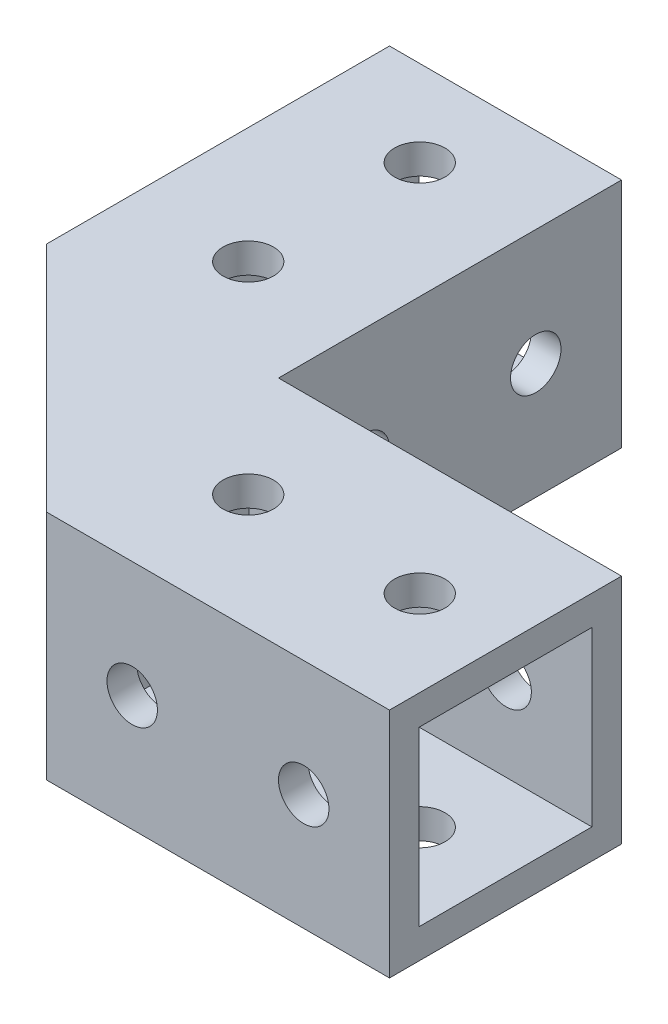
ISO-10303-21;
HEADER;
FILE_DESCRIPTION(('STEP AP214'),'2;1');
FILE_NAME('part.step','',(''),(''),'','','');
FILE_SCHEMA(('AUTOMOTIVE_DESIGN { 1 0 10303 214 1 1 1 1 }'));
ENDSEC;
DATA;
#1=APPLICATION_CONTEXT('core data for automotive mechanical design processes');
#2=APPLICATION_PROTOCOL_DEFINITION('international standard','automotive_design',2000,#1);
#3=PRODUCT_CONTEXT('',#1,'mechanical');
#4=PRODUCT('Part','Part','',(#3));
#5=PRODUCT_RELATED_PRODUCT_CATEGORY('part','',(#4));
#6=PRODUCT_DEFINITION_FORMATION('','',#4);
#7=PRODUCT_DEFINITION_CONTEXT('part definition',#1,'design');
#8=PRODUCT_DEFINITION('design','',#6,#7);
#9=PRODUCT_DEFINITION_SHAPE('','',#8);
#10=(LENGTH_UNIT() NAMED_UNIT(*) SI_UNIT(.MILLI.,.METRE.));
#11=(NAMED_UNIT(*) PLANE_ANGLE_UNIT() SI_UNIT($,.RADIAN.));
#12=(NAMED_UNIT(*) SI_UNIT($,.STERADIAN.) SOLID_ANGLE_UNIT());
#13=UNCERTAINTY_MEASURE_WITH_UNIT(LENGTH_MEASURE(1.E-05),#10,'distance_accuracy_value','');
#14=(GEOMETRIC_REPRESENTATION_CONTEXT(3) GLOBAL_UNCERTAINTY_ASSIGNED_CONTEXT((#13)) GLOBAL_UNIT_ASSIGNED_CONTEXT((#10,
#11,#12)) REPRESENTATION_CONTEXT('',''));
#15=CARTESIAN_POINT('',(0.,0.,0.));
#16=DIRECTION('',(0.,0.,1.));
#17=DIRECTION('',(1.,0.,0.));
#18=AXIS2_PLACEMENT_3D('',#15,#16,#17);
#19=CARTESIAN_POINT('',(0.,23.,0.));
#20=DIRECTION('',(0.,0.,1.));
#21=DIRECTION('',(1.,0.,0.));
#22=AXIS2_PLACEMENT_3D('',#19,#20,#21);
#23=PLANE('',#22);
#24=CARTESIAN_POINT('',(8.49999999999997,11.5,0.));
#25=DIRECTION('',(0.,0.,-1.));
#26=DIRECTION('',(-1.,0.,0.));
#27=AXIS2_PLACEMENT_3D('',#24,#25,#26);
#28=CIRCLE('',#27,2.5);
#29=CARTESIAN_POINT('',(5.99999999999997,11.5,0.));
#30=VERTEX_POINT('',#29);
#31=EDGE_CURVE('E438',#30,#30,#28,.T.);
#32=ORIENTED_EDGE('',*,*,#31,.F.);
#33=EDGE_LOOP('',(#32));
#34=FACE_BOUND('',#33,.T.);
#35=CARTESIAN_POINT('',(25.5,11.5,0.));
#36=DIRECTION('',(0.,0.,-1.));
#37=DIRECTION('',(-1.,0.,0.));
#38=AXIS2_PLACEMENT_3D('',#35,#36,#37);
#39=CIRCLE('',#38,2.5);
#40=CARTESIAN_POINT('',(23.,11.5,0.));
#41=VERTEX_POINT('',#40);
#42=EDGE_CURVE('E442',#41,#41,#39,.T.);
#43=ORIENTED_EDGE('',*,*,#42,.F.);
#44=EDGE_LOOP('',(#43));
#45=FACE_BOUND('',#44,.T.);
#46=DIRECTION('',(1.,0.,0.));
#47=VECTOR('',#46,1.);
#48=CARTESIAN_POINT('',(0.,4.,0.));
#49=LINE('',#48,#47);
#50=CARTESIAN_POINT('',(0.,4.,0.));
#51=VERTEX_POINT('',#50);
#52=CARTESIAN_POINT('',(17.,4.,0.));
#53=VERTEX_POINT('',#52);
#54=EDGE_CURVE('E185',#51,#53,#49,.T.);
#55=ORIENTED_EDGE('',*,*,#54,.F.);
#56=DIRECTION('',(0.,-1.,0.));
#57=VECTOR('',#56,1.);
#58=CARTESIAN_POINT('',(0.,23.,0.));
#59=LINE('',#58,#57);
#60=CARTESIAN_POINT('',(0.,23.,0.));
#61=VERTEX_POINT('',#60);
#62=EDGE_CURVE('E330',#61,#51,#59,.T.);
#63=ORIENTED_EDGE('',*,*,#62,.F.);
#64=DIRECTION('',(-1.,0.,0.));
#65=VECTOR('',#64,1.);
#66=CARTESIAN_POINT('',(0.,23.,0.));
#67=LINE('',#66,#65);
#68=CARTESIAN_POINT('',(34.,23.,0.));
#69=VERTEX_POINT('',#68);
#70=EDGE_CURVE('E476',#69,#61,#67,.T.);
#71=ORIENTED_EDGE('',*,*,#70,.F.);
#72=DIRECTION('',(0.,-1.,0.));
#73=VECTOR('',#72,1.);
#74=CARTESIAN_POINT('',(34.,23.,0.));
#75=LINE('',#74,#73);
#76=CARTESIAN_POINT('',(34.,0.,0.));
#77=VERTEX_POINT('',#76);
#78=EDGE_CURVE('E480',#69,#77,#75,.T.);
#79=ORIENTED_EDGE('',*,*,#78,.T.);
#80=DIRECTION('',(-1.,0.,0.));
#81=VECTOR('',#80,1.);
#82=CARTESIAN_POINT('',(0.,0.,0.));
#83=LINE('',#82,#81);
#84=CARTESIAN_POINT('',(17.,0.,0.));
#85=VERTEX_POINT('',#84);
#86=EDGE_CURVE('E72',#77,#85,#83,.T.);
#87=ORIENTED_EDGE('',*,*,#86,.T.);
#88=DIRECTION('',(0.,-1.,0.));
#89=VECTOR('',#88,1.);
#90=CARTESIAN_POINT('',(17.,4.,0.));
#91=LINE('',#90,#89);
#92=EDGE_CURVE('E67',#53,#85,#91,.T.);
#93=ORIENTED_EDGE('',*,*,#92,.F.);
#94=EDGE_LOOP('',(#55,#63,#71,#79,#87,#93));
#95=FACE_BOUND('',#94,.T.);
#96=ADVANCED_FACE('F49',(#34,#45,#95),#23,.F.);
#97=CARTESIAN_POINT('',(0.,23.,0.));
#98=DIRECTION('',(-1.,0.,0.));
#99=DIRECTION('',(0.,0.,-1.));
#100=AXIS2_PLACEMENT_3D('',#97,#98,#99);
#101=PLANE('',#100);
#102=CARTESIAN_POINT('',(-1.07580611086178E-13,11.5,-25.5));
#103=DIRECTION('',(-1.,0.,0.));
#104=DIRECTION('',(0.,0.,1.));
#105=AXIS2_PLACEMENT_3D('',#102,#103,#104);
#106=CIRCLE('',#105,2.5);
#107=CARTESIAN_POINT('',(0.,11.5,-23.));
#108=VERTEX_POINT('',#107);
#109=EDGE_CURVE('E289',#108,#108,#106,.T.);
#110=ORIENTED_EDGE('',*,*,#109,.T.);
#111=EDGE_LOOP('',(#110));
#112=FACE_BOUND('',#111,.T.);
#113=CARTESIAN_POINT('',(0.,11.5,-8.49999999999997));
#114=DIRECTION('',(-1.,0.,0.));
#115=DIRECTION('',(0.,0.,1.));
#116=AXIS2_PLACEMENT_3D('',#113,#114,#115);
#117=CIRCLE('',#116,2.5);
#118=CARTESIAN_POINT('',(0.,11.5,-5.99999999999997));
#119=VERTEX_POINT('',#118);
#120=EDGE_CURVE('E285',#119,#119,#117,.T.);
#121=ORIENTED_EDGE('',*,*,#120,.T.);
#122=EDGE_LOOP('',(#121));
#123=FACE_BOUND('',#122,.T.);
#124=DIRECTION('',(0.,0.,1.));
#125=VECTOR('',#124,1.);
#126=CARTESIAN_POINT('',(-1.43982048506075E-13,4.,-17.));
#127=LINE('',#126,#125);
#128=CARTESIAN_POINT('',(-1.43982048506075E-13,4.,-17.));
#129=VERTEX_POINT('',#128);
#130=EDGE_CURVE('E201',#129,#51,#127,.T.);
#131=ORIENTED_EDGE('',*,*,#130,.F.);
#132=DIRECTION('',(0.,-1.,0.));
#133=VECTOR('',#132,1.);
#134=CARTESIAN_POINT('',(-1.43982048506075E-13,4.,-17.));
#135=LINE('',#134,#133);
#136=CARTESIAN_POINT('',(0.,0.,-16.9999999999999));
#137=VERTEX_POINT('',#136);
#138=EDGE_CURVE('E197',#129,#137,#135,.T.);
#139=ORIENTED_EDGE('',*,*,#138,.T.);
#140=DIRECTION('',(0.,0.,1.));
#141=VECTOR('',#140,1.);
#142=CARTESIAN_POINT('',(0.,0.,0.));
#143=LINE('',#142,#141);
#144=CARTESIAN_POINT('',(-1.4344081478157E-13,0.,-34.));
#145=VERTEX_POINT('',#144);
#146=EDGE_CURVE('E322',#145,#137,#143,.T.);
#147=ORIENTED_EDGE('',*,*,#146,.F.);
#148=DIRECTION('',(0.,-1.,0.));
#149=VECTOR('',#148,1.);
#150=CARTESIAN_POINT('',(-1.4344081478157E-13,23.,-34.));
#151=LINE('',#150,#149);
#152=CARTESIAN_POINT('',(-1.4344081478157E-13,23.,-34.));
#153=VERTEX_POINT('',#152);
#154=EDGE_CURVE('E344',#153,#145,#151,.T.);
#155=ORIENTED_EDGE('',*,*,#154,.F.);
#156=DIRECTION('',(0.,0.,1.));
#157=VECTOR('',#156,1.);
#158=CARTESIAN_POINT('',(0.,23.,0.));
#159=LINE('',#158,#157);
#160=EDGE_CURVE('E326',#153,#61,#159,.T.);
#161=ORIENTED_EDGE('',*,*,#160,.T.);
#162=ORIENTED_EDGE('',*,*,#62,.T.);
#163=EDGE_LOOP('',(#131,#139,#147,#155,#161,#162));
#164=FACE_BOUND('',#163,.T.);
#165=ADVANCED_FACE('F538',(#112,#123,#164),#101,.F.);
#166=CARTESIAN_POINT('',(8.5,23.,11.5));
#167=DIRECTION('',(0.,-1.,0.));
#168=DIRECTION('',(0.,0.,-1.));
#169=AXIS2_PLACEMENT_3D('',#166,#167,#168);
#170=CYLINDRICAL_SURFACE('',#169,2.5);
#171=CARTESIAN_POINT('',(8.5,20.06,11.5));
#172=DIRECTION('',(0.,1.,0.));
#173=DIRECTION('',(0.,0.,1.));
#174=AXIS2_PLACEMENT_3D('',#171,#172,#173);
#175=CIRCLE('',#174,2.5);
#176=CARTESIAN_POINT('',(8.5,20.06,14.));
#177=VERTEX_POINT('',#176);
#178=EDGE_CURVE('E433',#177,#177,#175,.T.);
#179=ORIENTED_EDGE('',*,*,#178,.F.);
#180=EDGE_LOOP('',(#179));
#181=FACE_BOUND('',#180,.T.);
#182=CARTESIAN_POINT('',(8.5,23.,11.5));
#183=DIRECTION('',(0.,1.,0.));
#184=DIRECTION('',(0.,0.,1.));
#185=AXIS2_PLACEMENT_3D('',#182,#183,#184);
#186=CIRCLE('',#185,2.5);
#187=CARTESIAN_POINT('',(8.5,23.,14.));
#188=VERTEX_POINT('',#187);
#189=EDGE_CURVE('E462',#188,#188,#186,.T.);
#190=ORIENTED_EDGE('',*,*,#189,.T.);
#191=EDGE_LOOP('',(#190));
#192=FACE_BOUND('',#191,.T.);
#193=ADVANCED_FACE('F578',(#181,#192),#170,.F.);
#194=CARTESIAN_POINT('',(25.5,23.,11.5));
#195=DIRECTION('',(0.,-1.,0.));
#196=DIRECTION('',(0.,0.,-1.));
#197=AXIS2_PLACEMENT_3D('',#194,#195,#196);
#198=CYLINDRICAL_SURFACE('',#197,2.5);
#199=CARTESIAN_POINT('',(25.5,20.06,11.5));
#200=DIRECTION('',(0.,1.,0.));
#201=DIRECTION('',(0.,0.,1.));
#202=AXIS2_PLACEMENT_3D('',#199,#200,#201);
#203=CIRCLE('',#202,2.5);
#204=CARTESIAN_POINT('',(25.5,20.06,14.));
#205=VERTEX_POINT('',#204);
#206=EDGE_CURVE('E429',#205,#205,#203,.T.);
#207=ORIENTED_EDGE('',*,*,#206,.F.);
#208=EDGE_LOOP('',(#207));
#209=FACE_BOUND('',#208,.T.);
#210=CARTESIAN_POINT('',(25.5,23.,11.5));
#211=DIRECTION('',(0.,1.,0.));
#212=DIRECTION('',(0.,0.,1.));
#213=AXIS2_PLACEMENT_3D('',#210,#211,#212);
#214=CIRCLE('',#213,2.5);
#215=CARTESIAN_POINT('',(25.5,23.,14.));
#216=VERTEX_POINT('',#215);
#217=EDGE_CURVE('E454',#216,#216,#214,.T.);
#218=ORIENTED_EDGE('',*,*,#217,.T.);
#219=EDGE_LOOP('',(#218));
#220=FACE_BOUND('',#219,.T.);
#221=ADVANCED_FACE('F655',(#209,#220),#198,.F.);
#222=CARTESIAN_POINT('',(0.,23.,0.));
#223=DIRECTION('',(0.,1.,0.));
#224=DIRECTION('',(0.,0.,1.));
#225=AXIS2_PLACEMENT_3D('',#222,#223,#224);
#226=PLANE('',#225);
#227=ORIENTED_EDGE('',*,*,#189,.F.);
#228=EDGE_LOOP('',(#227));
#229=FACE_BOUND('',#228,.T.);
#230=ORIENTED_EDGE('',*,*,#70,.T.);
#231=ORIENTED_EDGE('',*,*,#160,.F.);
#232=DIRECTION('',(1.,0.,0.));
#233=VECTOR('',#232,1.);
#234=CARTESIAN_POINT('',(-1.4344081478157E-13,23.,-34.));
#235=LINE('',#234,#233);
#236=CARTESIAN_POINT('',(-23.0000000000001,23.,-33.9999999999999));
#237=VERTEX_POINT('',#236);
#238=EDGE_CURVE('E321',#237,#153,#235,.T.);
#239=ORIENTED_EDGE('',*,*,#238,.F.);
#240=DIRECTION('',(0.,0.,-1.));
#241=VECTOR('',#240,1.);
#242=CARTESIAN_POINT('',(-23.,23.,0.));
#243=LINE('',#242,#241);
#244=CARTESIAN_POINT('',(-23.,23.,0.));
#245=VERTEX_POINT('',#244);
#246=EDGE_CURVE('E317',#245,#237,#243,.T.);
#247=ORIENTED_EDGE('',*,*,#246,.F.);
#248=DIRECTION('',(0.707106781186549,0.,0.707106781186546));
#249=VECTOR('',#248,1.);
#250=CARTESIAN_POINT('',(-23.,23.,0.));
#251=LINE('',#250,#249);
#252=CARTESIAN_POINT('',(0.,23.,23.));
#253=VERTEX_POINT('',#252);
#254=EDGE_CURVE('E360',#245,#253,#251,.T.);
#255=ORIENTED_EDGE('',*,*,#254,.T.);
#256=DIRECTION('',(1.,0.,0.));
#257=VECTOR('',#256,1.);
#258=CARTESIAN_POINT('',(0.,23.,23.));
#259=LINE('',#258,#257);
#260=CARTESIAN_POINT('',(34.,23.,23.));
#261=VERTEX_POINT('',#260);
#262=EDGE_CURVE('E470',#253,#261,#259,.T.);
#263=ORIENTED_EDGE('',*,*,#262,.T.);
#264=DIRECTION('',(0.,0.,-1.));
#265=VECTOR('',#264,1.);
#266=CARTESIAN_POINT('',(34.,23.,0.));
#267=LINE('',#266,#265);
#268=EDGE_CURVE('E473',#261,#69,#267,.T.);
#269=ORIENTED_EDGE('',*,*,#268,.T.);
#270=EDGE_LOOP('',(#230,#231,#239,#247,#255,#263,#269));
#271=FACE_BOUND('',#270,.T.);
#272=ORIENTED_EDGE('',*,*,#217,.F.);
#273=EDGE_LOOP('',(#272));
#274=FACE_BOUND('',#273,.T.);
#275=CARTESIAN_POINT('',(-11.5,23.,-8.49999999999996));
#276=DIRECTION('',(0.,-1.,0.));
#277=DIRECTION('',(-1.,0.,0.));
#278=AXIS2_PLACEMENT_3D('',#275,#276,#277);
#279=CIRCLE('',#278,2.5);
#280=CARTESIAN_POINT('',(-14.,23.,-8.49999999999995));
#281=VERTEX_POINT('',#280);
#282=EDGE_CURVE('E309',#281,#281,#279,.T.);
#283=ORIENTED_EDGE('',*,*,#282,.T.);
#284=EDGE_LOOP('',(#283));
#285=FACE_BOUND('',#284,.T.);
#286=CARTESIAN_POINT('',(-11.5000000000001,23.,-25.5));
#287=DIRECTION('',(0.,-1.,0.));
#288=DIRECTION('',(-1.,0.,0.));
#289=AXIS2_PLACEMENT_3D('',#286,#287,#288);
#290=CIRCLE('',#289,2.5);
#291=CARTESIAN_POINT('',(-14.0000000000001,23.,-25.4999999999999));
#292=VERTEX_POINT('',#291);
#293=EDGE_CURVE('E301',#292,#292,#290,.T.);
#294=ORIENTED_EDGE('',*,*,#293,.T.);
#295=EDGE_LOOP('',(#294));
#296=FACE_BOUND('',#295,.T.);
#297=ADVANCED_FACE('F542',(#229,#271,#274,#285,#296),#226,.T.);
#298=CARTESIAN_POINT('',(0.,0.,0.));
#299=DIRECTION('',(0.,1.,0.));
#300=DIRECTION('',(0.,0.,1.));
#301=AXIS2_PLACEMENT_3D('',#298,#299,#300);
#302=PLANE('',#301);
#303=DIRECTION('',(-0.689736149918452,0.,-0.7240608009661));
#304=VECTOR('',#303,1.);
#305=CARTESIAN_POINT('',(8.70636593799587,0.,-8.7063659379959));
#306=LINE('',#305,#304);
#307=CARTESIAN_POINT('',(8.70636593799587,0.,-8.7063659379959));
#308=VERTEX_POINT('',#307);
#309=EDGE_CURVE('E192',#85,#308,#306,.T.);
#310=ORIENTED_EDGE('',*,*,#309,.F.);
#311=ORIENTED_EDGE('',*,*,#86,.F.);
#312=DIRECTION('',(0.,0.,-1.));
#313=VECTOR('',#312,1.);
#314=CARTESIAN_POINT('',(34.,0.,0.));
#315=LINE('',#314,#313);
#316=CARTESIAN_POINT('',(34.,0.,23.));
#317=VERTEX_POINT('',#316);
#318=EDGE_CURVE('E483',#317,#77,#315,.T.);
#319=ORIENTED_EDGE('',*,*,#318,.F.);
#320=DIRECTION('',(1.,0.,0.));
#321=VECTOR('',#320,1.);
#322=CARTESIAN_POINT('',(0.,0.,23.));
#323=LINE('',#322,#321);
#324=CARTESIAN_POINT('',(0.,0.,23.));
#325=VERTEX_POINT('',#324);
#326=EDGE_CURVE('E466',#325,#317,#323,.T.);
#327=ORIENTED_EDGE('',*,*,#326,.F.);
#328=DIRECTION('',(0.707106781186549,0.,0.707106781186546));
#329=VECTOR('',#328,1.);
#330=CARTESIAN_POINT('',(-23.,0.,0.));
#331=LINE('',#330,#329);
#332=CARTESIAN_POINT('',(-23.,0.,0.));
#333=VERTEX_POINT('',#332);
#334=EDGE_CURVE('E350',#333,#325,#331,.T.);
#335=ORIENTED_EDGE('',*,*,#334,.F.);
#336=DIRECTION('',(0.,0.,-1.));
#337=VECTOR('',#336,1.);
#338=CARTESIAN_POINT('',(-23.,0.,0.));
#339=LINE('',#338,#337);
#340=CARTESIAN_POINT('',(-23.0000000000001,0.,-33.9999999999999));
#341=VERTEX_POINT('',#340);
#342=EDGE_CURVE('E313',#333,#341,#339,.T.);
#343=ORIENTED_EDGE('',*,*,#342,.T.);
#344=DIRECTION('',(1.,0.,0.));
#345=VECTOR('',#344,1.);
#346=CARTESIAN_POINT('',(-1.4344081478157E-13,0.,-34.));
#347=LINE('',#346,#345);
#348=EDGE_CURVE('E334',#341,#145,#347,.T.);
#349=ORIENTED_EDGE('',*,*,#348,.T.);
#350=ORIENTED_EDGE('',*,*,#146,.T.);
#351=DIRECTION('',(-0.724060800966106,0.,-0.689736149918446));
#352=VECTOR('',#351,1.);
#353=CARTESIAN_POINT('',(8.70636593799587,0.,-8.7063659379959));
#354=LINE('',#353,#352);
#355=EDGE_CURVE('E209',#308,#137,#354,.T.);
#356=ORIENTED_EDGE('',*,*,#355,.F.);
#357=EDGE_LOOP('',(#310,#311,#319,#327,#335,#343,#349,#350,#356));
#358=FACE_BOUND('',#357,.T.);
#359=CARTESIAN_POINT('',(8.5,0.,11.5));
#360=DIRECTION('',(0.,1.,0.));
#361=DIRECTION('',(0.,0.,1.));
#362=AXIS2_PLACEMENT_3D('',#359,#360,#361);
#363=CIRCLE('',#362,2.5);
#364=CARTESIAN_POINT('',(8.5,0.,14.));
#365=VERTEX_POINT('',#364);
#366=EDGE_CURVE('E458',#365,#365,#363,.T.);
#367=ORIENTED_EDGE('',*,*,#366,.T.);
#368=EDGE_LOOP('',(#367));
#369=FACE_BOUND('',#368,.T.);
#370=CARTESIAN_POINT('',(25.5,0.,11.5));
#371=DIRECTION('',(0.,1.,0.));
#372=DIRECTION('',(0.,0.,1.));
#373=AXIS2_PLACEMENT_3D('',#370,#371,#372);
#374=CIRCLE('',#373,2.5);
#375=CARTESIAN_POINT('',(25.5,0.,14.));
#376=VERTEX_POINT('',#375);
#377=EDGE_CURVE('E450',#376,#376,#374,.T.);
#378=ORIENTED_EDGE('',*,*,#377,.T.);
#379=EDGE_LOOP('',(#378));
#380=FACE_BOUND('',#379,.T.);
#381=CARTESIAN_POINT('',(-11.5,0.,-8.49999999999996));
#382=DIRECTION('',(0.,-1.,0.));
#383=DIRECTION('',(-1.,0.,0.));
#384=AXIS2_PLACEMENT_3D('',#381,#382,#383);
#385=CIRCLE('',#384,2.5);
#386=CARTESIAN_POINT('',(-14.,0.,-8.49999999999995));
#387=VERTEX_POINT('',#386);
#388=EDGE_CURVE('E305',#387,#387,#385,.T.);
#389=ORIENTED_EDGE('',*,*,#388,.F.);
#390=EDGE_LOOP('',(#389));
#391=FACE_BOUND('',#390,.T.);
#392=CARTESIAN_POINT('',(-11.5000000000001,0.,-25.5));
#393=DIRECTION('',(0.,-1.,0.));
#394=DIRECTION('',(-1.,0.,0.));
#395=AXIS2_PLACEMENT_3D('',#392,#393,#394);
#396=CIRCLE('',#395,2.5);
#397=CARTESIAN_POINT('',(-14.0000000000001,0.,-25.4999999999999));
#398=VERTEX_POINT('',#397);
#399=EDGE_CURVE('E297',#398,#398,#396,.T.);
#400=ORIENTED_EDGE('',*,*,#399,.F.);
#401=EDGE_LOOP('',(#400));
#402=FACE_BOUND('',#401,.T.);
#403=CARTESIAN_POINT('',(5.17083203206314,0.,-5.17083203206316));
#404=DIRECTION('',(0.,1.,0.));
#405=DIRECTION('',(0.,0.,1.));
#406=AXIS2_PLACEMENT_3D('',#403,#404,#405);
#407=CIRCLE('',#406,2.5);
#408=CARTESIAN_POINT('',(5.17083203206314,0.,-2.67083203206316));
#409=VERTEX_POINT('',#408);
#410=EDGE_CURVE('E935',#409,#409,#407,.T.);
#411=ORIENTED_EDGE('',*,*,#410,.T.);
#412=EDGE_LOOP('',(#411));
#413=FACE_BOUND('',#412,.T.);
#414=ADVANCED_FACE('F525',(#358,#369,#380,#391,#402,#413),#302,.F.);
#415=CARTESIAN_POINT('',(0.,23.,23.));
#416=DIRECTION('',(0.,0.,-1.));
#417=DIRECTION('',(-1.,0.,0.));
#418=AXIS2_PLACEMENT_3D('',#415,#416,#417);
#419=PLANE('',#418);
#420=CARTESIAN_POINT('',(8.49999999999997,11.5,23.));
#421=DIRECTION('',(0.,0.,-1.));
#422=DIRECTION('',(-1.,0.,0.));
#423=AXIS2_PLACEMENT_3D('',#420,#421,#422);
#424=CIRCLE('',#423,2.5);
#425=CARTESIAN_POINT('',(5.99999999999997,11.5,23.));
#426=VERTEX_POINT('',#425);
#427=EDGE_CURVE('E437',#426,#426,#424,.T.);
#428=ORIENTED_EDGE('',*,*,#427,.T.);
#429=EDGE_LOOP('',(#428));
#430=FACE_BOUND('',#429,.T.);
#431=CARTESIAN_POINT('',(25.5,11.5,23.));
#432=DIRECTION('',(0.,0.,-1.));
#433=DIRECTION('',(-1.,0.,0.));
#434=AXIS2_PLACEMENT_3D('',#431,#432,#433);
#435=CIRCLE('',#434,2.5);
#436=CARTESIAN_POINT('',(23.,11.5,23.));
#437=VERTEX_POINT('',#436);
#438=EDGE_CURVE('E446',#437,#437,#435,.T.);
#439=ORIENTED_EDGE('',*,*,#438,.T.);
#440=EDGE_LOOP('',(#439));
#441=FACE_BOUND('',#440,.T.);
#442=ORIENTED_EDGE('',*,*,#326,.T.);
#443=DIRECTION('',(0.,-1.,0.));
#444=VECTOR('',#443,1.);
#445=CARTESIAN_POINT('',(34.,23.,23.));
#446=LINE('',#445,#444);
#447=EDGE_CURVE('E59',#261,#317,#446,.T.);
#448=ORIENTED_EDGE('',*,*,#447,.F.);
#449=ORIENTED_EDGE('',*,*,#262,.F.);
#450=DIRECTION('',(0.,-1.,0.));
#451=VECTOR('',#450,1.);
#452=CARTESIAN_POINT('',(0.,23.,23.));
#453=LINE('',#452,#451);
#454=EDGE_CURVE('E12',#253,#325,#453,.T.);
#455=ORIENTED_EDGE('',*,*,#454,.T.);
#456=EDGE_LOOP('',(#442,#448,#449,#455));
#457=FACE_BOUND('',#456,.T.);
#458=ADVANCED_FACE('F51',(#430,#441,#457),#419,.F.);
#459=CARTESIAN_POINT('',(34.,23.,0.));
#460=DIRECTION('',(-1.,0.,0.));
#461=DIRECTION('',(0.,0.,1.));
#462=AXIS2_PLACEMENT_3D('',#459,#460,#461);
#463=PLANE('',#462);
#464=DIRECTION('',(0.,0.,1.));
#465=VECTOR('',#464,1.);
#466=CARTESIAN_POINT('',(34.,20.06,20.06));
#467=LINE('',#466,#465);
#468=CARTESIAN_POINT('',(34.,20.06,2.94));
#469=VERTEX_POINT('',#468);
#470=CARTESIAN_POINT('',(34.,20.06,20.06));
#471=VERTEX_POINT('',#470);
#472=EDGE_CURVE('E392',#469,#471,#467,.T.);
#473=ORIENTED_EDGE('',*,*,#472,.F.);
#474=DIRECTION('',(0.,1.,0.));
#475=VECTOR('',#474,1.);
#476=CARTESIAN_POINT('',(34.,20.06,2.94));
#477=LINE('',#476,#475);
#478=CARTESIAN_POINT('',(34.,2.94,2.94));
#479=VERTEX_POINT('',#478);
#480=EDGE_CURVE('E371',#479,#469,#477,.T.);
#481=ORIENTED_EDGE('',*,*,#480,.F.);
#482=DIRECTION('',(0.,0.,-1.));
#483=VECTOR('',#482,1.);
#484=CARTESIAN_POINT('',(34.,2.94,20.06));
#485=LINE('',#484,#483);
#486=CARTESIAN_POINT('',(34.,2.94,20.06));
#487=VERTEX_POINT('',#486);
#488=EDGE_CURVE('E377',#487,#479,#485,.T.);
#489=ORIENTED_EDGE('',*,*,#488,.F.);
#490=DIRECTION('',(0.,-1.,0.));
#491=VECTOR('',#490,1.);
#492=CARTESIAN_POINT('',(34.,20.06,20.06));
#493=LINE('',#492,#491);
#494=EDGE_CURVE('E396',#471,#487,#493,.T.);
#495=ORIENTED_EDGE('',*,*,#494,.F.);
#496=EDGE_LOOP('',(#473,#481,#489,#495));
#497=FACE_BOUND('',#496,.T.);
#498=ORIENTED_EDGE('',*,*,#318,.T.);
#499=ORIENTED_EDGE('',*,*,#78,.F.);
#500=ORIENTED_EDGE('',*,*,#268,.F.);
#501=ORIENTED_EDGE('',*,*,#447,.T.);
#502=EDGE_LOOP('',(#498,#499,#500,#501));
#503=FACE_BOUND('',#502,.T.);
#504=ADVANCED_FACE('F524',(#497,#503),#463,.F.);
#505=CARTESIAN_POINT('',(8.5,2.94,11.5));
#506=DIRECTION('',(0.,-1.,0.));
#507=DIRECTION('',(0.,0.,-1.));
#508=AXIS2_PLACEMENT_3D('',#505,#506,#507);
#509=CIRCLE('',#508,2.5);
#510=CARTESIAN_POINT('',(8.5,2.94,9.));
#511=VERTEX_POINT('',#510);
#512=EDGE_CURVE('E425',#511,#511,#509,.T.);
#513=ORIENTED_EDGE('',*,*,#512,.F.);
#514=EDGE_LOOP('',(#513));
#515=FACE_BOUND('',#514,.T.);
#516=ORIENTED_EDGE('',*,*,#366,.F.);
#517=EDGE_LOOP('',(#516));
#518=FACE_BOUND('',#517,.T.);
#519=ADVANCED_FACE('F667',(#515,#518),#170,.F.);
#520=CARTESIAN_POINT('',(25.5,2.94,11.5));
#521=DIRECTION('',(0.,-1.,0.));
#522=DIRECTION('',(0.,0.,-1.));
#523=AXIS2_PLACEMENT_3D('',#520,#521,#522);
#524=CIRCLE('',#523,2.5);
#525=CARTESIAN_POINT('',(25.5,2.94,9.));
#526=VERTEX_POINT('',#525);
#527=EDGE_CURVE('E53',#526,#526,#524,.T.);
#528=ORIENTED_EDGE('',*,*,#527,.F.);
#529=EDGE_LOOP('',(#528));
#530=FACE_BOUND('',#529,.T.);
#531=ORIENTED_EDGE('',*,*,#377,.F.);
#532=EDGE_LOOP('',(#531));
#533=FACE_BOUND('',#532,.T.);
#534=ADVANCED_FACE('F518',(#530,#533),#198,.F.);
#535=CARTESIAN_POINT('',(25.5,11.5,23.));
#536=DIRECTION('',(0.,0.,-1.));
#537=DIRECTION('',(-1.,0.,0.));
#538=AXIS2_PLACEMENT_3D('',#535,#536,#537);
#539=CYLINDRICAL_SURFACE('',#538,2.5);
#540=CARTESIAN_POINT('',(25.5,11.5,20.06));
#541=DIRECTION('',(0.,0.,1.));
#542=DIRECTION('',(0.,-1.,0.));
#543=AXIS2_PLACEMENT_3D('',#540,#541,#542);
#544=CIRCLE('',#543,2.5);
#545=CARTESIAN_POINT('',(25.5,9.,20.06));
#546=VERTEX_POINT('',#545);
#547=EDGE_CURVE('E421',#546,#546,#544,.F.);
#548=ORIENTED_EDGE('',*,*,#547,.T.);
#549=EDGE_LOOP('',(#548));
#550=FACE_BOUND('',#549,.T.);
#551=ORIENTED_EDGE('',*,*,#438,.F.);
#552=EDGE_LOOP('',(#551));
#553=FACE_BOUND('',#552,.T.);
#554=ADVANCED_FACE('F514',(#550,#553),#539,.F.);
#555=CARTESIAN_POINT('',(25.5,11.5,2.94));
#556=DIRECTION('',(0.,0.,-1.));
#557=DIRECTION('',(0.,1.,0.));
#558=AXIS2_PLACEMENT_3D('',#555,#556,#557);
#559=CIRCLE('',#558,2.5);
#560=CARTESIAN_POINT('',(25.5,14.,2.94));
#561=VERTEX_POINT('',#560);
#562=EDGE_CURVE('E416',#561,#561,#559,.F.);
#563=ORIENTED_EDGE('',*,*,#562,.T.);
#564=EDGE_LOOP('',(#563));
#565=FACE_BOUND('',#564,.T.);
#566=ORIENTED_EDGE('',*,*,#42,.T.);
#567=EDGE_LOOP('',(#566));
#568=FACE_BOUND('',#567,.T.);
#569=ADVANCED_FACE('F517',(#565,#568),#539,.F.);
#570=CARTESIAN_POINT('',(8.49999999999997,11.5,23.));
#571=DIRECTION('',(0.,0.,-1.));
#572=DIRECTION('',(-1.,0.,0.));
#573=AXIS2_PLACEMENT_3D('',#570,#571,#572);
#574=CYLINDRICAL_SURFACE('',#573,2.5);
#575=CARTESIAN_POINT('',(8.49999999999997,11.5,20.06));
#576=DIRECTION('',(0.,0.,1.));
#577=DIRECTION('',(0.,-1.,0.));
#578=AXIS2_PLACEMENT_3D('',#575,#576,#577);
#579=CIRCLE('',#578,2.5);
#580=CARTESIAN_POINT('',(8.49999999999997,9.,20.06));
#581=VERTEX_POINT('',#580);
#582=EDGE_CURVE('E420',#581,#581,#579,.F.);
#583=ORIENTED_EDGE('',*,*,#582,.T.);
#584=EDGE_LOOP('',(#583));
#585=FACE_BOUND('',#584,.T.);
#586=ORIENTED_EDGE('',*,*,#427,.F.);
#587=EDGE_LOOP('',(#586));
#588=FACE_BOUND('',#587,.T.);
#589=ADVANCED_FACE('F499',(#585,#588),#574,.F.);
#590=CARTESIAN_POINT('',(8.49999999999997,11.5,2.94));
#591=DIRECTION('',(0.,0.,-1.));
#592=DIRECTION('',(0.,1.,0.));
#593=AXIS2_PLACEMENT_3D('',#590,#591,#592);
#594=CIRCLE('',#593,2.5);
#595=CARTESIAN_POINT('',(8.49999999999997,14.,2.94));
#596=VERTEX_POINT('',#595);
#597=EDGE_CURVE('E406',#596,#596,#594,.F.);
#598=ORIENTED_EDGE('',*,*,#597,.T.);
#599=EDGE_LOOP('',(#598));
#600=FACE_BOUND('',#599,.T.);
#601=ORIENTED_EDGE('',*,*,#31,.T.);
#602=EDGE_LOOP('',(#601));
#603=FACE_BOUND('',#602,.T.);
#604=ADVANCED_FACE('F506',(#600,#603),#574,.F.);
#605=CARTESIAN_POINT('',(0.,20.06,20.06));
#606=DIRECTION('',(0.,0.,1.));
#607=DIRECTION('',(0.,-1.,0.));
#608=AXIS2_PLACEMENT_3D('',#605,#606,#607);
#609=PLANE('',#608);
#610=ORIENTED_EDGE('',*,*,#582,.F.);
#611=EDGE_LOOP('',(#610));
#612=FACE_BOUND('',#611,.T.);
#613=ORIENTED_EDGE('',*,*,#494,.T.);
#614=DIRECTION('',(1.,0.,0.));
#615=VECTOR('',#614,1.);
#616=CARTESIAN_POINT('',(0.,2.94,20.06));
#617=LINE('',#616,#615);
#618=CARTESIAN_POINT('',(0.,2.94,20.06));
#619=VERTEX_POINT('',#618);
#620=EDGE_CURVE('E407',#619,#487,#617,.T.);
#621=ORIENTED_EDGE('',*,*,#620,.F.);
#622=DIRECTION('',(0.,-1.,0.));
#623=VECTOR('',#622,1.);
#624=CARTESIAN_POINT('',(0.,20.06,20.06));
#625=LINE('',#624,#623);
#626=CARTESIAN_POINT('',(0.,20.06,20.06));
#627=VERTEX_POINT('',#626);
#628=EDGE_CURVE('E381',#627,#619,#625,.T.);
#629=ORIENTED_EDGE('',*,*,#628,.F.);
#630=DIRECTION('',(1.,0.,0.));
#631=VECTOR('',#630,1.);
#632=CARTESIAN_POINT('',(0.,20.06,20.06));
#633=LINE('',#632,#631);
#634=EDGE_CURVE('E410',#627,#471,#633,.T.);
#635=ORIENTED_EDGE('',*,*,#634,.T.);
#636=EDGE_LOOP('',(#613,#621,#629,#635));
#637=FACE_BOUND('',#636,.T.);
#638=ORIENTED_EDGE('',*,*,#547,.F.);
#639=EDGE_LOOP('',(#638));
#640=FACE_BOUND('',#639,.T.);
#641=ADVANCED_FACE('F502',(#612,#637,#640),#609,.F.);
#642=CARTESIAN_POINT('',(0.,20.06,2.94));
#643=DIRECTION('',(0.,0.,-1.));
#644=DIRECTION('',(0.,1.,0.));
#645=AXIS2_PLACEMENT_3D('',#642,#643,#644);
#646=PLANE('',#645);
#647=ORIENTED_EDGE('',*,*,#597,.F.);
#648=EDGE_LOOP('',(#647));
#649=FACE_BOUND('',#648,.T.);
#650=ORIENTED_EDGE('',*,*,#480,.T.);
#651=DIRECTION('',(1.,0.,0.));
#652=VECTOR('',#651,1.);
#653=CARTESIAN_POINT('',(0.,20.06,2.94));
#654=LINE('',#653,#652);
#655=CARTESIAN_POINT('',(0.,20.06,2.94));
#656=VERTEX_POINT('',#655);
#657=EDGE_CURVE('E389',#656,#469,#654,.T.);
#658=ORIENTED_EDGE('',*,*,#657,.F.);
#659=DIRECTION('',(0.,1.,0.));
#660=VECTOR('',#659,1.);
#661=CARTESIAN_POINT('',(0.,20.06,2.94));
#662=LINE('',#661,#660);
#663=CARTESIAN_POINT('',(0.,2.94,2.94));
#664=VERTEX_POINT('',#663);
#665=EDGE_CURVE('E372',#664,#656,#662,.T.);
#666=ORIENTED_EDGE('',*,*,#665,.F.);
#667=DIRECTION('',(1.,0.,0.));
#668=VECTOR('',#667,1.);
#669=CARTESIAN_POINT('',(0.,2.94,2.94));
#670=LINE('',#669,#668);
#671=EDGE_CURVE('E403',#664,#479,#670,.T.);
#672=ORIENTED_EDGE('',*,*,#671,.T.);
#673=EDGE_LOOP('',(#650,#658,#666,#672));
#674=FACE_BOUND('',#673,.T.);
#675=ORIENTED_EDGE('',*,*,#562,.F.);
#676=EDGE_LOOP('',(#675));
#677=FACE_BOUND('',#676,.T.);
#678=ADVANCED_FACE('F505',(#649,#674,#677),#646,.F.);
#679=CARTESIAN_POINT('',(0.,2.94,20.06));
#680=DIRECTION('',(0.,-1.,0.));
#681=DIRECTION('',(0.,0.,-1.));
#682=AXIS2_PLACEMENT_3D('',#679,#680,#681);
#683=PLANE('',#682);
#684=ORIENTED_EDGE('',*,*,#512,.T.);
#685=EDGE_LOOP('',(#684));
#686=FACE_BOUND('',#685,.T.);
#687=ORIENTED_EDGE('',*,*,#527,.T.);
#688=EDGE_LOOP('',(#687));
#689=FACE_BOUND('',#688,.T.);
#690=ORIENTED_EDGE('',*,*,#488,.T.);
#691=ORIENTED_EDGE('',*,*,#671,.F.);
#692=DIRECTION('',(0.,0.,-1.));
#693=VECTOR('',#692,1.);
#694=CARTESIAN_POINT('',(0.,2.94,20.06));
#695=LINE('',#694,#693);
#696=EDGE_CURVE('E385',#619,#664,#695,.T.);
#697=ORIENTED_EDGE('',*,*,#696,.F.);
#698=ORIENTED_EDGE('',*,*,#620,.T.);
#699=EDGE_LOOP('',(#690,#691,#697,#698));
#700=FACE_BOUND('',#699,.T.);
#701=ADVANCED_FACE('F679',(#686,#689,#700),#683,.F.);
#702=CARTESIAN_POINT('',(0.,20.06,20.06));
#703=DIRECTION('',(0.,1.,0.));
#704=DIRECTION('',(0.,0.,1.));
#705=AXIS2_PLACEMENT_3D('',#702,#703,#704);
#706=PLANE('',#705);
#707=ORIENTED_EDGE('',*,*,#178,.T.);
#708=EDGE_LOOP('',(#707));
#709=FACE_BOUND('',#708,.T.);
#710=ORIENTED_EDGE('',*,*,#206,.T.);
#711=EDGE_LOOP('',(#710));
#712=FACE_BOUND('',#711,.T.);
#713=ORIENTED_EDGE('',*,*,#472,.T.);
#714=ORIENTED_EDGE('',*,*,#634,.F.);
#715=DIRECTION('',(0.,0.,1.));
#716=VECTOR('',#715,1.);
#717=CARTESIAN_POINT('',(0.,20.06,20.06));
#718=LINE('',#717,#716);
#719=EDGE_CURVE('E376',#656,#627,#718,.T.);
#720=ORIENTED_EDGE('',*,*,#719,.F.);
#721=ORIENTED_EDGE('',*,*,#657,.T.);
#722=EDGE_LOOP('',(#713,#714,#720,#721));
#723=FACE_BOUND('',#722,.T.);
#724=ADVANCED_FACE('F681',(#709,#712,#723),#706,.F.);
#725=CARTESIAN_POINT('',(0.,23.,0.));
#726=DIRECTION('',(-1.,0.,0.));
#727=DIRECTION('',(0.,0.,1.));
#728=AXIS2_PLACEMENT_3D('',#725,#726,#727);
#729=PLANE('',#728);
#730=ORIENTED_EDGE('',*,*,#628,.T.);
#731=ORIENTED_EDGE('',*,*,#696,.T.);
#732=ORIENTED_EDGE('',*,*,#665,.T.);
#733=ORIENTED_EDGE('',*,*,#719,.T.);
#734=EDGE_LOOP('',(#730,#731,#732,#733));
#735=FACE_BOUND('',#734,.T.);
#736=ADVANCED_FACE('F683',(#735),#729,.F.);
#737=CARTESIAN_POINT('',(-23.,23.,0.));
#738=DIRECTION('',(0.707106781186546,0.,-0.707106781186549));
#739=DIRECTION('',(-0.707106781186549,0.,-0.707106781186546));
#740=AXIS2_PLACEMENT_3D('',#737,#738,#739);
#741=PLANE('',#740);
#742=ORIENTED_EDGE('',*,*,#334,.T.);
#743=ORIENTED_EDGE('',*,*,#454,.F.);
#744=ORIENTED_EDGE('',*,*,#254,.F.);
#745=DIRECTION('',(0.,-1.,0.));
#746=VECTOR('',#745,1.);
#747=CARTESIAN_POINT('',(-23.,23.,0.));
#748=LINE('',#747,#746);
#749=EDGE_CURVE('E364',#245,#333,#748,.T.);
#750=ORIENTED_EDGE('',*,*,#749,.T.);
#751=EDGE_LOOP('',(#742,#743,#744,#750));
#752=FACE_BOUND('',#751,.T.);
#753=ADVANCED_FACE('F548',(#752),#741,.F.);
#754=CARTESIAN_POINT('',(-11.5,23.,-8.49999999999996));
#755=DIRECTION('',(0.,-1.,0.));
#756=DIRECTION('',(1.,0.,0.));
#757=AXIS2_PLACEMENT_3D('',#754,#755,#756);
#758=CYLINDRICAL_SURFACE('',#757,2.5);
#759=CARTESIAN_POINT('',(-11.5,20.06,-8.49999999999996));
#760=DIRECTION('',(0.,-1.,0.));
#761=DIRECTION('',(-1.,0.,0.));
#762=AXIS2_PLACEMENT_3D('',#759,#760,#761);
#763=CIRCLE('',#762,2.5);
#764=CARTESIAN_POINT('',(-14.,20.06,-8.49999999999995));
#765=VERTEX_POINT('',#764);
#766=EDGE_CURVE('E280',#765,#765,#763,.T.);
#767=ORIENTED_EDGE('',*,*,#766,.T.);
#768=EDGE_LOOP('',(#767));
#769=FACE_BOUND('',#768,.T.);
#770=ORIENTED_EDGE('',*,*,#282,.F.);
#771=EDGE_LOOP('',(#770));
#772=FACE_BOUND('',#771,.T.);
#773=ADVANCED_FACE('F565',(#769,#772),#758,.F.);
#774=CARTESIAN_POINT('',(-11.5000000000001,23.,-25.5));
#775=DIRECTION('',(0.,-1.,0.));
#776=DIRECTION('',(1.,0.,0.));
#777=AXIS2_PLACEMENT_3D('',#774,#775,#776);
#778=CYLINDRICAL_SURFACE('',#777,2.5);
#779=CARTESIAN_POINT('',(-11.5000000000001,20.06,-25.5));
#780=DIRECTION('',(0.,-1.,0.));
#781=DIRECTION('',(-1.,0.,0.));
#782=AXIS2_PLACEMENT_3D('',#779,#780,#781);
#783=CIRCLE('',#782,2.5);
#784=CARTESIAN_POINT('',(-14.0000000000001,20.06,-25.4999999999999));
#785=VERTEX_POINT('',#784);
#786=EDGE_CURVE('E276',#785,#785,#783,.T.);
#787=ORIENTED_EDGE('',*,*,#786,.T.);
#788=EDGE_LOOP('',(#787));
#789=FACE_BOUND('',#788,.T.);
#790=ORIENTED_EDGE('',*,*,#293,.F.);
#791=EDGE_LOOP('',(#790));
#792=FACE_BOUND('',#791,.T.);
#793=ADVANCED_FACE('F566',(#789,#792),#778,.F.);
#794=CARTESIAN_POINT('',(-23.,23.,0.));
#795=DIRECTION('',(1.,0.,0.));
#796=DIRECTION('',(0.,0.,1.));
#797=AXIS2_PLACEMENT_3D('',#794,#795,#796);
#798=PLANE('',#797);
#799=CARTESIAN_POINT('',(-23.,11.5,-8.49999999999988));
#800=DIRECTION('',(-1.,0.,0.));
#801=DIRECTION('',(0.,0.,1.));
#802=AXIS2_PLACEMENT_3D('',#799,#800,#801);
#803=CIRCLE('',#802,2.5);
#804=CARTESIAN_POINT('',(-23.,11.5,-5.99999999999988));
#805=VERTEX_POINT('',#804);
#806=EDGE_CURVE('E284',#805,#805,#803,.T.);
#807=ORIENTED_EDGE('',*,*,#806,.F.);
#808=EDGE_LOOP('',(#807));
#809=FACE_BOUND('',#808,.T.);
#810=CARTESIAN_POINT('',(-23.0000000000001,11.5,-25.4999999999999));
#811=DIRECTION('',(-1.,0.,0.));
#812=DIRECTION('',(0.,0.,1.));
#813=AXIS2_PLACEMENT_3D('',#810,#811,#812);
#814=CIRCLE('',#813,2.5);
#815=CARTESIAN_POINT('',(-23.0000000000001,11.5,-22.9999999999999));
#816=VERTEX_POINT('',#815);
#817=EDGE_CURVE('E293',#816,#816,#814,.T.);
#818=ORIENTED_EDGE('',*,*,#817,.F.);
#819=EDGE_LOOP('',(#818));
#820=FACE_BOUND('',#819,.T.);
#821=ORIENTED_EDGE('',*,*,#342,.F.);
#822=ORIENTED_EDGE('',*,*,#749,.F.);
#823=ORIENTED_EDGE('',*,*,#246,.T.);
#824=DIRECTION('',(0.,-1.,0.));
#825=VECTOR('',#824,1.);
#826=CARTESIAN_POINT('',(-23.0000000000001,23.,-33.9999999999999));
#827=LINE('',#826,#825);
#828=EDGE_CURVE('E347',#237,#341,#827,.T.);
#829=ORIENTED_EDGE('',*,*,#828,.T.);
#830=EDGE_LOOP('',(#821,#822,#823,#829));
#831=FACE_BOUND('',#830,.T.);
#832=ADVANCED_FACE('F551',(#809,#820,#831),#798,.F.);
#833=CARTESIAN_POINT('',(-1.4344081478157E-13,23.,-34.));
#834=DIRECTION('',(0.,0.,1.));
#835=DIRECTION('',(-1.,0.,0.));
#836=AXIS2_PLACEMENT_3D('',#833,#834,#835);
#837=PLANE('',#836);
#838=DIRECTION('',(-1.,0.,0.));
#839=VECTOR('',#838,1.);
#840=CARTESIAN_POINT('',(-20.0600000000001,20.06,-33.9999999999999));
#841=LINE('',#840,#839);
#842=CARTESIAN_POINT('',(-2.94000000000015,20.06,-34.));
#843=VERTEX_POINT('',#842);
#844=CARTESIAN_POINT('',(-20.0600000000001,20.06,-33.9999999999999));
#845=VERTEX_POINT('',#844);
#846=EDGE_CURVE('E239',#843,#845,#841,.T.);
#847=ORIENTED_EDGE('',*,*,#846,.T.);
#848=DIRECTION('',(0.,-1.,0.));
#849=VECTOR('',#848,1.);
#850=CARTESIAN_POINT('',(-20.0600000000001,20.06,-33.9999999999999));
#851=LINE('',#850,#849);
#852=CARTESIAN_POINT('',(-20.0600000000001,2.94,-33.9999999999999));
#853=VERTEX_POINT('',#852);
#854=EDGE_CURVE('E243',#845,#853,#851,.T.);
#855=ORIENTED_EDGE('',*,*,#854,.T.);
#856=DIRECTION('',(1.,0.,0.));
#857=VECTOR('',#856,1.);
#858=CARTESIAN_POINT('',(-20.0600000000001,2.94,-33.9999999999999));
#859=LINE('',#858,#857);
#860=CARTESIAN_POINT('',(-2.94000000000014,2.94,-34.));
#861=VERTEX_POINT('',#860);
#862=EDGE_CURVE('E223',#853,#861,#859,.T.);
#863=ORIENTED_EDGE('',*,*,#862,.T.);
#864=DIRECTION('',(0.,1.,0.));
#865=VECTOR('',#864,1.);
#866=CARTESIAN_POINT('',(-2.94000000000015,20.06,-34.));
#867=LINE('',#866,#865);
#868=EDGE_CURVE('E217',#861,#843,#867,.T.);
#869=ORIENTED_EDGE('',*,*,#868,.T.);
#870=EDGE_LOOP('',(#847,#855,#863,#869));
#871=FACE_BOUND('',#870,.T.);
#872=ORIENTED_EDGE('',*,*,#348,.F.);
#873=ORIENTED_EDGE('',*,*,#828,.F.);
#874=ORIENTED_EDGE('',*,*,#238,.T.);
#875=ORIENTED_EDGE('',*,*,#154,.T.);
#876=EDGE_LOOP('',(#872,#873,#874,#875));
#877=FACE_BOUND('',#876,.T.);
#878=ADVANCED_FACE('F553',(#871,#877),#837,.F.);
#879=CARTESIAN_POINT('',(-11.5,2.94,-8.49999999999996));
#880=DIRECTION('',(0.,1.,0.));
#881=DIRECTION('',(1.,0.,0.));
#882=AXIS2_PLACEMENT_3D('',#879,#880,#881);
#883=CIRCLE('',#882,2.5);
#884=CARTESIAN_POINT('',(-9.00000000000004,2.94,-8.49999999999997));
#885=VERTEX_POINT('',#884);
#886=EDGE_CURVE('E272',#885,#885,#883,.T.);
#887=ORIENTED_EDGE('',*,*,#886,.T.);
#888=EDGE_LOOP('',(#887));
#889=FACE_BOUND('',#888,.T.);
#890=ORIENTED_EDGE('',*,*,#388,.T.);
#891=EDGE_LOOP('',(#890));
#892=FACE_BOUND('',#891,.T.);
#893=ADVANCED_FACE('F555',(#889,#892),#758,.F.);
#894=CARTESIAN_POINT('',(-11.5000000000001,2.94,-25.5));
#895=DIRECTION('',(0.,1.,0.));
#896=DIRECTION('',(1.,0.,0.));
#897=AXIS2_PLACEMENT_3D('',#894,#895,#896);
#898=CIRCLE('',#897,2.5);
#899=CARTESIAN_POINT('',(-9.00000000000011,2.94,-25.5));
#900=VERTEX_POINT('',#899);
#901=EDGE_CURVE('E271',#900,#900,#898,.T.);
#902=ORIENTED_EDGE('',*,*,#901,.T.);
#903=EDGE_LOOP('',(#902));
#904=FACE_BOUND('',#903,.T.);
#905=ORIENTED_EDGE('',*,*,#399,.T.);
#906=EDGE_LOOP('',(#905));
#907=FACE_BOUND('',#906,.T.);
#908=ADVANCED_FACE('F562',(#904,#907),#778,.F.);
#909=CARTESIAN_POINT('',(-23.0000000000001,11.5,-25.4999999999999));
#910=DIRECTION('',(1.,0.,0.));
#911=DIRECTION('',(0.,0.,1.));
#912=AXIS2_PLACEMENT_3D('',#909,#910,#911);
#913=CYLINDRICAL_SURFACE('',#912,2.5);
#914=CARTESIAN_POINT('',(-20.0600000000001,11.5,-25.4999999999999));
#915=DIRECTION('',(1.,0.,0.));
#916=DIRECTION('',(0.,-1.,0.));
#917=AXIS2_PLACEMENT_3D('',#914,#915,#916);
#918=CIRCLE('',#917,2.5);
#919=CARTESIAN_POINT('',(-20.0600000000001,9.,-25.4999999999999));
#920=VERTEX_POINT('',#919);
#921=EDGE_CURVE('E267',#920,#920,#918,.F.);
#922=ORIENTED_EDGE('',*,*,#921,.F.);
#923=EDGE_LOOP('',(#922));
#924=FACE_BOUND('',#923,.T.);
#925=ORIENTED_EDGE('',*,*,#817,.T.);
#926=EDGE_LOOP('',(#925));
#927=FACE_BOUND('',#926,.T.);
#928=ADVANCED_FACE('F618',(#924,#927),#913,.F.);
#929=CARTESIAN_POINT('',(-2.94000000000011,11.5,-25.5));
#930=DIRECTION('',(-1.,0.,0.));
#931=DIRECTION('',(0.,1.,0.));
#932=AXIS2_PLACEMENT_3D('',#929,#930,#931);
#933=CIRCLE('',#932,2.5);
#934=CARTESIAN_POINT('',(-2.94000000000011,14.,-25.5));
#935=VERTEX_POINT('',#934);
#936=EDGE_CURVE('E262',#935,#935,#933,.F.);
#937=ORIENTED_EDGE('',*,*,#936,.F.);
#938=EDGE_LOOP('',(#937));
#939=FACE_BOUND('',#938,.T.);
#940=ORIENTED_EDGE('',*,*,#109,.F.);
#941=EDGE_LOOP('',(#940));
#942=FACE_BOUND('',#941,.T.);
#943=ADVANCED_FACE('F614',(#939,#942),#913,.F.);
#944=CARTESIAN_POINT('',(-23.,11.5,-8.49999999999988));
#945=DIRECTION('',(1.,0.,0.));
#946=DIRECTION('',(0.,0.,1.));
#947=AXIS2_PLACEMENT_3D('',#944,#945,#946);
#948=CYLINDRICAL_SURFACE('',#947,2.5);
#949=CARTESIAN_POINT('',(-20.06,11.5,-8.49999999999989));
#950=DIRECTION('',(1.,0.,0.));
#951=DIRECTION('',(0.,-1.,0.));
#952=AXIS2_PLACEMENT_3D('',#949,#950,#951);
#953=CIRCLE('',#952,2.5);
#954=CARTESIAN_POINT('',(-20.06,9.,-8.49999999999989));
#955=VERTEX_POINT('',#954);
#956=EDGE_CURVE('E266',#955,#955,#953,.F.);
#957=ORIENTED_EDGE('',*,*,#956,.F.);
#958=EDGE_LOOP('',(#957));
#959=FACE_BOUND('',#958,.T.);
#960=ORIENTED_EDGE('',*,*,#806,.T.);
#961=EDGE_LOOP('',(#960));
#962=FACE_BOUND('',#961,.T.);
#963=ADVANCED_FACE('F617',(#959,#962),#948,.F.);
#964=CARTESIAN_POINT('',(-2.94000000000004,11.5,-8.49999999999996));
#965=DIRECTION('',(-1.,0.,0.));
#966=DIRECTION('',(0.,1.,0.));
#967=AXIS2_PLACEMENT_3D('',#964,#965,#966);
#968=CIRCLE('',#967,2.5);
#969=CARTESIAN_POINT('',(-2.94000000000004,14.,-8.49999999999996));
#970=VERTEX_POINT('',#969);
#971=EDGE_CURVE('E253',#970,#970,#968,.F.);
#972=ORIENTED_EDGE('',*,*,#971,.F.);
#973=EDGE_LOOP('',(#972));
#974=FACE_BOUND('',#973,.T.);
#975=ORIENTED_EDGE('',*,*,#120,.F.);
#976=EDGE_LOOP('',(#975));
#977=FACE_BOUND('',#976,.T.);
#978=ADVANCED_FACE('F624',(#974,#977),#948,.F.);
#979=CARTESIAN_POINT('',(-20.06,20.06,1.07931441561959E-13));
#980=DIRECTION('',(-1.,0.,0.));
#981=DIRECTION('',(0.,-1.,0.));
#982=AXIS2_PLACEMENT_3D('',#979,#980,#981);
#983=PLANE('',#982);
#984=ORIENTED_EDGE('',*,*,#956,.T.);
#985=EDGE_LOOP('',(#984));
#986=FACE_BOUND('',#985,.T.);
#987=ORIENTED_EDGE('',*,*,#854,.F.);
#988=DIRECTION('',(0.,0.,-1.));
#989=VECTOR('',#988,1.);
#990=CARTESIAN_POINT('',(-20.06,20.06,1.07931441561959E-13));
#991=LINE('',#990,#989);
#992=CARTESIAN_POINT('',(-20.06,20.06,0.));
#993=VERTEX_POINT('',#992);
#994=EDGE_CURVE('E257',#993,#845,#991,.T.);
#995=ORIENTED_EDGE('',*,*,#994,.F.);
#996=DIRECTION('',(0.,-1.,0.));
#997=VECTOR('',#996,1.);
#998=CARTESIAN_POINT('',(-20.06,20.06,1.07931441561959E-13));
#999=LINE('',#998,#997);
#1000=CARTESIAN_POINT('',(-20.06,2.94,1.07931441561959E-13));
#1001=VERTEX_POINT('',#1000);
#1002=EDGE_CURVE('E227',#993,#1001,#999,.T.);
#1003=ORIENTED_EDGE('',*,*,#1002,.T.);
#1004=DIRECTION('',(0.,0.,-1.));
#1005=VECTOR('',#1004,1.);
#1006=CARTESIAN_POINT('',(-20.06,2.94,1.07931441561959E-13));
#1007=LINE('',#1006,#1005);
#1008=EDGE_CURVE('E254',#1001,#853,#1007,.T.);
#1009=ORIENTED_EDGE('',*,*,#1008,.T.);
#1010=EDGE_LOOP('',(#987,#995,#1003,#1009));
#1011=FACE_BOUND('',#1010,.T.);
#1012=ORIENTED_EDGE('',*,*,#921,.T.);
#1013=EDGE_LOOP('',(#1012));
#1014=FACE_BOUND('',#1013,.T.);
#1015=ADVANCED_FACE('F600',(#986,#1011,#1014),#983,.F.);
#1016=CARTESIAN_POINT('',(-2.94,20.06,0.));
#1017=DIRECTION('',(1.,0.,0.));
#1018=DIRECTION('',(0.,1.,0.));
#1019=AXIS2_PLACEMENT_3D('',#1016,#1017,#1018);
#1020=PLANE('',#1019);
#1021=ORIENTED_EDGE('',*,*,#971,.T.);
#1022=EDGE_LOOP('',(#1021));
#1023=FACE_BOUND('',#1022,.T.);
#1024=ORIENTED_EDGE('',*,*,#868,.F.);
#1025=DIRECTION('',(0.,0.,-1.));
#1026=VECTOR('',#1025,1.);
#1027=CARTESIAN_POINT('',(-2.94,2.94,0.));
#1028=LINE('',#1027,#1026);
#1029=CARTESIAN_POINT('',(-2.94,2.94,0.));
#1030=VERTEX_POINT('',#1029);
#1031=EDGE_CURVE('E250',#1030,#861,#1028,.T.);
#1032=ORIENTED_EDGE('',*,*,#1031,.F.);
#1033=DIRECTION('',(0.,1.,0.));
#1034=VECTOR('',#1033,1.);
#1035=CARTESIAN_POINT('',(-2.94,20.06,0.));
#1036=LINE('',#1035,#1034);
#1037=CARTESIAN_POINT('',(-2.94,20.06,0.));
#1038=VERTEX_POINT('',#1037);
#1039=EDGE_CURVE('E218',#1030,#1038,#1036,.T.);
#1040=ORIENTED_EDGE('',*,*,#1039,.T.);
#1041=DIRECTION('',(0.,0.,-1.));
#1042=VECTOR('',#1041,1.);
#1043=CARTESIAN_POINT('',(-2.94,20.06,0.));
#1044=LINE('',#1043,#1042);
#1045=EDGE_CURVE('E235',#1038,#843,#1044,.T.);
#1046=ORIENTED_EDGE('',*,*,#1045,.T.);
#1047=EDGE_LOOP('',(#1024,#1032,#1040,#1046));
#1048=FACE_BOUND('',#1047,.T.);
#1049=ORIENTED_EDGE('',*,*,#936,.T.);
#1050=EDGE_LOOP('',(#1049));
#1051=FACE_BOUND('',#1050,.T.);
#1052=ADVANCED_FACE('F607',(#1023,#1048,#1051),#1020,.F.);
#1053=CARTESIAN_POINT('',(-20.06,2.94,1.07931441561959E-13));
#1054=DIRECTION('',(0.,-1.,0.));
#1055=DIRECTION('',(1.,0.,0.));
#1056=AXIS2_PLACEMENT_3D('',#1053,#1054,#1055);
#1057=PLANE('',#1056);
#1058=ORIENTED_EDGE('',*,*,#886,.F.);
#1059=EDGE_LOOP('',(#1058));
#1060=FACE_BOUND('',#1059,.T.);
#1061=ORIENTED_EDGE('',*,*,#901,.F.);
#1062=EDGE_LOOP('',(#1061));
#1063=FACE_BOUND('',#1062,.T.);
#1064=ORIENTED_EDGE('',*,*,#862,.F.);
#1065=ORIENTED_EDGE('',*,*,#1008,.F.);
#1066=DIRECTION('',(1.,0.,0.));
#1067=VECTOR('',#1066,1.);
#1068=CARTESIAN_POINT('',(-20.06,2.94,1.07931441561959E-13));
#1069=LINE('',#1068,#1067);
#1070=EDGE_CURVE('E231',#1001,#1030,#1069,.T.);
#1071=ORIENTED_EDGE('',*,*,#1070,.T.);
#1072=ORIENTED_EDGE('',*,*,#1031,.T.);
#1073=EDGE_LOOP('',(#1064,#1065,#1071,#1072));
#1074=FACE_BOUND('',#1073,.T.);
#1075=ADVANCED_FACE('F590',(#1060,#1063,#1074),#1057,.F.);
#1076=CARTESIAN_POINT('',(-20.06,20.06,1.07931441561959E-13));
#1077=DIRECTION('',(0.,1.,0.));
#1078=DIRECTION('',(-1.,0.,0.));
#1079=AXIS2_PLACEMENT_3D('',#1076,#1077,#1078);
#1080=PLANE('',#1079);
#1081=ORIENTED_EDGE('',*,*,#766,.F.);
#1082=EDGE_LOOP('',(#1081));
#1083=FACE_BOUND('',#1082,.T.);
#1084=ORIENTED_EDGE('',*,*,#786,.F.);
#1085=EDGE_LOOP('',(#1084));
#1086=FACE_BOUND('',#1085,.T.);
#1087=ORIENTED_EDGE('',*,*,#846,.F.);
#1088=ORIENTED_EDGE('',*,*,#1045,.F.);
#1089=DIRECTION('',(-1.,0.,0.));
#1090=VECTOR('',#1089,1.);
#1091=CARTESIAN_POINT('',(-20.06,20.06,1.07931441561959E-13));
#1092=LINE('',#1091,#1090);
#1093=EDGE_CURVE('E222',#1038,#993,#1092,.T.);
#1094=ORIENTED_EDGE('',*,*,#1093,.T.);
#1095=ORIENTED_EDGE('',*,*,#994,.T.);
#1096=EDGE_LOOP('',(#1087,#1088,#1094,#1095));
#1097=FACE_BOUND('',#1096,.T.);
#1098=ADVANCED_FACE('F583',(#1083,#1086,#1097),#1080,.F.);
#1099=ORIENTED_EDGE('',*,*,#1070,.F.);
#1100=ORIENTED_EDGE('',*,*,#1002,.F.);
#1101=ORIENTED_EDGE('',*,*,#1093,.F.);
#1102=ORIENTED_EDGE('',*,*,#1039,.F.);
#1103=EDGE_LOOP('',(#1099,#1100,#1101,#1102));
#1104=FACE_BOUND('',#1103,.T.);
#1105=ADVANCED_FACE('F573',(#1104),#23,.F.);
#1106=CARTESIAN_POINT('',(0.,4.,0.));
#1107=DIRECTION('',(0.,-1.,0.));
#1108=DIRECTION('',(0.,0.,-1.));
#1109=AXIS2_PLACEMENT_3D('',#1106,#1107,#1108);
#1110=PLANE('',#1109);
#1111=ORIENTED_EDGE('',*,*,#54,.T.);
#1112=DIRECTION('',(-0.689736149918452,0.,-0.7240608009661));
#1113=VECTOR('',#1112,1.);
#1114=CARTESIAN_POINT('',(8.70636593799587,4.,-8.7063659379959));
#1115=LINE('',#1114,#1113);
#1116=CARTESIAN_POINT('',(8.70636593799587,4.,-8.7063659379959));
#1117=VERTEX_POINT('',#1116);
#1118=EDGE_CURVE('E177',#53,#1117,#1115,.T.);
#1119=ORIENTED_EDGE('',*,*,#1118,.T.);
#1120=DIRECTION('',(-0.724060800966106,0.,-0.689736149918446));
#1121=VECTOR('',#1120,1.);
#1122=CARTESIAN_POINT('',(8.70636593799587,4.,-8.7063659379959));
#1123=LINE('',#1122,#1121);
#1124=EDGE_CURVE('E183',#1117,#129,#1123,.T.);
#1125=ORIENTED_EDGE('',*,*,#1124,.T.);
#1126=ORIENTED_EDGE('',*,*,#130,.T.);
#1127=EDGE_LOOP('',(#1111,#1119,#1125,#1126));
#1128=FACE_BOUND('',#1127,.T.);
#1129=CARTESIAN_POINT('',(5.17083203206314,4.,-5.17083203206316));
#1130=DIRECTION('',(0.,1.,0.));
#1131=DIRECTION('',(0.,0.,1.));
#1132=AXIS2_PLACEMENT_3D('',#1129,#1130,#1131);
#1133=CIRCLE('',#1132,2.5);
#1134=CARTESIAN_POINT('',(5.17083203206314,4.,-2.67083203206316));
#1135=VERTEX_POINT('',#1134);
#1136=EDGE_CURVE('E210',#1135,#1135,#1133,.T.);
#1137=ORIENTED_EDGE('',*,*,#1136,.F.);
#1138=EDGE_LOOP('',(#1137));
#1139=FACE_BOUND('',#1138,.T.);
#1140=ADVANCED_FACE('F179',(#1128,#1139),#1110,.F.);
#1141=CARTESIAN_POINT('',(8.70636593799587,4.,-8.7063659379959));
#1142=DIRECTION('',(-0.7240608009661,0.,0.689736149918452));
#1143=DIRECTION('',(0.689736149918452,0.,0.7240608009661));
#1144=AXIS2_PLACEMENT_3D('',#1141,#1142,#1143);
#1145=PLANE('',#1144);
#1146=ORIENTED_EDGE('',*,*,#309,.T.);
#1147=DIRECTION('',(0.,-1.,0.));
#1148=VECTOR('',#1147,1.);
#1149=CARTESIAN_POINT('',(8.70636593799587,4.,-8.7063659379959));
#1150=LINE('',#1149,#1148);
#1151=EDGE_CURVE('E190',#1117,#308,#1150,.T.);
#1152=ORIENTED_EDGE('',*,*,#1151,.F.);
#1153=ORIENTED_EDGE('',*,*,#1118,.F.);
#1154=ORIENTED_EDGE('',*,*,#92,.T.);
#1155=EDGE_LOOP('',(#1146,#1152,#1153,#1154));
#1156=FACE_BOUND('',#1155,.T.);
#1157=ADVANCED_FACE('F191',(#1156),#1145,.F.);
#1158=CARTESIAN_POINT('',(8.70636593799587,4.,-8.7063659379959));
#1159=DIRECTION('',(-0.689736149918446,0.,0.724060800966106));
#1160=DIRECTION('',(0.724060800966106,0.,0.689736149918446));
#1161=AXIS2_PLACEMENT_3D('',#1158,#1159,#1160);
#1162=PLANE('',#1161);
#1163=ORIENTED_EDGE('',*,*,#355,.T.);
#1164=ORIENTED_EDGE('',*,*,#138,.F.);
#1165=ORIENTED_EDGE('',*,*,#1124,.F.);
#1166=ORIENTED_EDGE('',*,*,#1151,.T.);
#1167=EDGE_LOOP('',(#1163,#1164,#1165,#1166));
#1168=FACE_BOUND('',#1167,.T.);
#1169=ADVANCED_FACE('F199',(#1168),#1162,.F.);
#1170=CARTESIAN_POINT('',(5.17083203206314,4.,-5.17083203206316));
#1171=DIRECTION('',(0.,-1.,0.));
#1172=DIRECTION('',(0.,0.,-1.));
#1173=AXIS2_PLACEMENT_3D('',#1170,#1171,#1172);
#1174=CYLINDRICAL_SURFACE('',#1173,2.5);
#1175=ORIENTED_EDGE('',*,*,#1136,.T.);
#1176=EDGE_LOOP('',(#1175));
#1177=FACE_BOUND('',#1176,.T.);
#1178=ORIENTED_EDGE('',*,*,#410,.F.);
#1179=EDGE_LOOP('',(#1178));
#1180=FACE_BOUND('',#1179,.T.);
#1181=ADVANCED_FACE('F914',(#1177,#1180),#1174,.F.);
#1182=CLOSED_SHELL('',(#96,#165,#193,#221,#297,#414,#458,#504,#519,#534,#554,#569,#589,#604,
#641,#678,#701,#724,#736,#753,#773,#793,#832,#878,#893,#908,#928,#943,#963,#978,#1015,#1052,
#1075,#1098,#1105,#1140,#1157,#1169,#1181));
#1183=MANIFOLD_SOLID_BREP('B2',#1182);
#1184=ADVANCED_BREP_SHAPE_REPRESENTATION('',(#18,#1183),#14);
#1185=SHAPE_DEFINITION_REPRESENTATION(#9,#1184);
ENDSEC;
END-ISO-10303-21;
